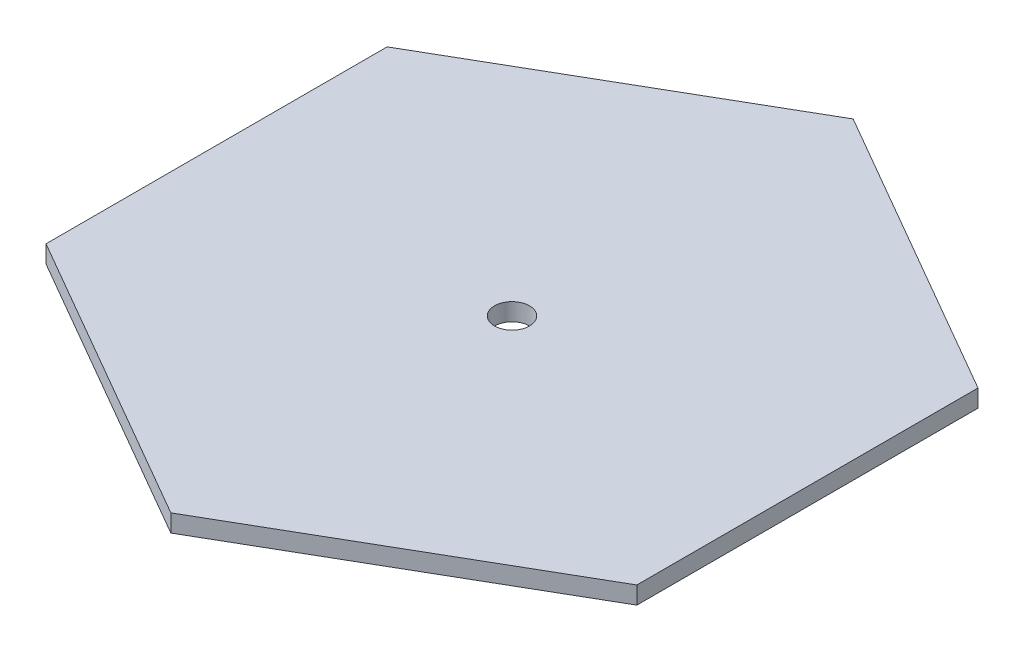
ISO-10303-21;
HEADER;
FILE_DESCRIPTION(('STEP AP214'),'2;1');
FILE_NAME('part.step','',(''),(''),'','','');
FILE_SCHEMA(('AUTOMOTIVE_DESIGN { 1 0 10303 214 1 1 1 1 }'));
ENDSEC;
DATA;
#1=APPLICATION_CONTEXT('core data for automotive mechanical design processes');
#2=APPLICATION_PROTOCOL_DEFINITION('international standard','automotive_design',2000,#1);
#3=PRODUCT_CONTEXT('',#1,'mechanical');
#4=PRODUCT('Part','Part','',(#3));
#5=PRODUCT_RELATED_PRODUCT_CATEGORY('part','',(#4));
#6=PRODUCT_DEFINITION_FORMATION('','',#4);
#7=PRODUCT_DEFINITION_CONTEXT('part definition',#1,'design');
#8=PRODUCT_DEFINITION('design','',#6,#7);
#9=PRODUCT_DEFINITION_SHAPE('','',#8);
#10=(LENGTH_UNIT() NAMED_UNIT(*) SI_UNIT(.MILLI.,.METRE.));
#11=(NAMED_UNIT(*) PLANE_ANGLE_UNIT() SI_UNIT($,.RADIAN.));
#12=(NAMED_UNIT(*) SI_UNIT($,.STERADIAN.) SOLID_ANGLE_UNIT());
#13=UNCERTAINTY_MEASURE_WITH_UNIT(LENGTH_MEASURE(1.E-05),#10,'distance_accuracy_value','');
#14=(GEOMETRIC_REPRESENTATION_CONTEXT(3) GLOBAL_UNCERTAINTY_ASSIGNED_CONTEXT((#13)) GLOBAL_UNIT_ASSIGNED_CONTEXT((#10,
#11,#12)) REPRESENTATION_CONTEXT('',''));
#15=CARTESIAN_POINT('',(0.,0.,0.));
#16=DIRECTION('',(0.,0.,1.));
#17=DIRECTION('',(1.,0.,0.));
#18=AXIS2_PLACEMENT_3D('',#15,#16,#17);
#19=CARTESIAN_POINT('',(33.7749907475931,2.,19.5));
#20=DIRECTION('',(-1.,0.,0.));
#21=DIRECTION('',(0.,0.,1.));
#22=AXIS2_PLACEMENT_3D('',#19,#20,#21);
#23=PLANE('',#22);
#24=DIRECTION('',(0.,0.,-1.));
#25=VECTOR('',#24,1.);
#26=CARTESIAN_POINT('',(33.7749907475931,0.,19.5));
#27=LINE('',#26,#25);
#28=CARTESIAN_POINT('',(33.7749907475931,0.,19.5));
#29=VERTEX_POINT('',#28);
#30=CARTESIAN_POINT('',(33.7749907475931,0.,-19.5));
#31=VERTEX_POINT('',#30);
#32=EDGE_CURVE('E116',#29,#31,#27,.T.);
#33=ORIENTED_EDGE('',*,*,#32,.T.);
#34=DIRECTION('',(0.,-1.,0.));
#35=VECTOR('',#34,1.);
#36=CARTESIAN_POINT('',(33.7749907475931,2.,-19.5));
#37=LINE('',#36,#35);
#38=CARTESIAN_POINT('',(33.7749907475931,2.,-19.5));
#39=VERTEX_POINT('',#38);
#40=EDGE_CURVE('E11',#39,#31,#37,.T.);
#41=ORIENTED_EDGE('',*,*,#40,.F.);
#42=DIRECTION('',(0.,0.,-1.));
#43=VECTOR('',#42,1.);
#44=CARTESIAN_POINT('',(33.7749907475931,2.,19.5));
#45=LINE('',#44,#43);
#46=CARTESIAN_POINT('',(33.7749907475931,2.,19.5));
#47=VERTEX_POINT('',#46);
#48=EDGE_CURVE('E127',#47,#39,#45,.T.);
#49=ORIENTED_EDGE('',*,*,#48,.F.);
#50=DIRECTION('',(0.,-1.,0.));
#51=VECTOR('',#50,1.);
#52=CARTESIAN_POINT('',(33.7749907475931,2.,19.5));
#53=LINE('',#52,#51);
#54=EDGE_CURVE('E112',#47,#29,#53,.T.);
#55=ORIENTED_EDGE('',*,*,#54,.T.);
#56=EDGE_LOOP('',(#33,#41,#49,#55));
#57=FACE_BOUND('',#56,.T.);
#58=ADVANCED_FACE('F32',(#57),#23,.F.);
#59=CARTESIAN_POINT('',(33.7749907475931,2.,-19.5));
#60=DIRECTION('',(-0.5,0.,0.866025403784439));
#61=DIRECTION('',(0.866025403784439,0.,0.5));
#62=AXIS2_PLACEMENT_3D('',#59,#60,#61);
#63=PLANE('',#62);
#64=DIRECTION('',(-0.866025403784439,0.,-0.5));
#65=VECTOR('',#64,1.);
#66=CARTESIAN_POINT('',(33.7749907475931,0.,-19.5));
#67=LINE('',#66,#65);
#68=CARTESIAN_POINT('',(0.,0.,-39.));
#69=VERTEX_POINT('',#68);
#70=EDGE_CURVE('E119',#31,#69,#67,.T.);
#71=ORIENTED_EDGE('',*,*,#70,.T.);
#72=DIRECTION('',(0.,-1.,0.));
#73=VECTOR('',#72,1.);
#74=CARTESIAN_POINT('',(0.,2.,-39.));
#75=LINE('',#74,#73);
#76=CARTESIAN_POINT('',(0.,2.,-39.));
#77=VERTEX_POINT('',#76);
#78=EDGE_CURVE('E40',#77,#69,#75,.T.);
#79=ORIENTED_EDGE('',*,*,#78,.F.);
#80=DIRECTION('',(-0.866025403784439,0.,-0.5));
#81=VECTOR('',#80,1.);
#82=CARTESIAN_POINT('',(33.7749907475931,2.,-19.5));
#83=LINE('',#82,#81);
#84=EDGE_CURVE('E85',#39,#77,#83,.T.);
#85=ORIENTED_EDGE('',*,*,#84,.F.);
#86=ORIENTED_EDGE('',*,*,#40,.T.);
#87=EDGE_LOOP('',(#71,#79,#85,#86));
#88=FACE_BOUND('',#87,.T.);
#89=ADVANCED_FACE('F152',(#88),#63,.F.);
#90=CARTESIAN_POINT('',(0.,2.,-39.));
#91=DIRECTION('',(0.5,0.,0.866025403784439));
#92=DIRECTION('',(0.866025403784439,0.,-0.5));
#93=AXIS2_PLACEMENT_3D('',#90,#91,#92);
#94=PLANE('',#93);
#95=DIRECTION('',(-0.866025403784439,0.,0.5));
#96=VECTOR('',#95,1.);
#97=CARTESIAN_POINT('',(0.,0.,-39.));
#98=LINE('',#97,#96);
#99=CARTESIAN_POINT('',(-33.7749907475931,0.,-19.5));
#100=VERTEX_POINT('',#99);
#101=EDGE_CURVE('E122',#69,#100,#98,.T.);
#102=ORIENTED_EDGE('',*,*,#101,.T.);
#103=DIRECTION('',(0.,-1.,0.));
#104=VECTOR('',#103,1.);
#105=CARTESIAN_POINT('',(-33.7749907475931,2.,-19.5));
#106=LINE('',#105,#104);
#107=CARTESIAN_POINT('',(-33.7749907475931,2.,-19.5));
#108=VERTEX_POINT('',#107);
#109=EDGE_CURVE('E107',#108,#100,#106,.T.);
#110=ORIENTED_EDGE('',*,*,#109,.F.);
#111=DIRECTION('',(-0.866025403784439,0.,0.5));
#112=VECTOR('',#111,1.);
#113=CARTESIAN_POINT('',(0.,2.,-39.));
#114=LINE('',#113,#112);
#115=EDGE_CURVE('E98',#77,#108,#114,.T.);
#116=ORIENTED_EDGE('',*,*,#115,.F.);
#117=ORIENTED_EDGE('',*,*,#78,.T.);
#118=EDGE_LOOP('',(#102,#110,#116,#117));
#119=FACE_BOUND('',#118,.T.);
#120=ADVANCED_FACE('F133',(#119),#94,.F.);
#121=CARTESIAN_POINT('',(-33.7749907475931,2.,-19.5));
#122=DIRECTION('',(1.,0.,0.));
#123=DIRECTION('',(0.,0.,-1.));
#124=AXIS2_PLACEMENT_3D('',#121,#122,#123);
#125=PLANE('',#124);
#126=DIRECTION('',(0.,0.,1.));
#127=VECTOR('',#126,1.);
#128=CARTESIAN_POINT('',(-33.7749907475931,0.,-19.5));
#129=LINE('',#128,#127);
#130=CARTESIAN_POINT('',(-33.7749907475931,0.,19.5));
#131=VERTEX_POINT('',#130);
#132=EDGE_CURVE('E106',#100,#131,#129,.T.);
#133=ORIENTED_EDGE('',*,*,#132,.T.);
#134=DIRECTION('',(0.,-1.,0.));
#135=VECTOR('',#134,1.);
#136=CARTESIAN_POINT('',(-33.7749907475931,2.,19.5));
#137=LINE('',#136,#135);
#138=CARTESIAN_POINT('',(-33.7749907475931,2.,19.5));
#139=VERTEX_POINT('',#138);
#140=EDGE_CURVE('E103',#139,#131,#137,.T.);
#141=ORIENTED_EDGE('',*,*,#140,.F.);
#142=DIRECTION('',(0.,0.,1.));
#143=VECTOR('',#142,1.);
#144=CARTESIAN_POINT('',(-33.7749907475931,2.,-19.5));
#145=LINE('',#144,#143);
#146=EDGE_CURVE('E92',#108,#139,#145,.T.);
#147=ORIENTED_EDGE('',*,*,#146,.F.);
#148=ORIENTED_EDGE('',*,*,#109,.T.);
#149=EDGE_LOOP('',(#133,#141,#147,#148));
#150=FACE_BOUND('',#149,.T.);
#151=ADVANCED_FACE('F104',(#150),#125,.F.);
#152=CARTESIAN_POINT('',(-33.7749907475931,2.,19.5));
#153=DIRECTION('',(0.5,0.,-0.866025403784439));
#154=DIRECTION('',(-0.866025403784439,0.,-0.5));
#155=AXIS2_PLACEMENT_3D('',#152,#153,#154);
#156=PLANE('',#155);
#157=DIRECTION('',(0.866025403784439,0.,0.5));
#158=VECTOR('',#157,1.);
#159=CARTESIAN_POINT('',(-33.7749907475931,0.,19.5));
#160=LINE('',#159,#158);
#161=CARTESIAN_POINT('',(0.,0.,39.));
#162=VERTEX_POINT('',#161);
#163=EDGE_CURVE('E71',#131,#162,#160,.T.);
#164=ORIENTED_EDGE('',*,*,#163,.T.);
#165=DIRECTION('',(0.,-1.,0.));
#166=VECTOR('',#165,1.);
#167=CARTESIAN_POINT('',(0.,2.,39.));
#168=LINE('',#167,#166);
#169=CARTESIAN_POINT('',(0.,2.,39.));
#170=VERTEX_POINT('',#169);
#171=EDGE_CURVE('E108',#170,#162,#168,.T.);
#172=ORIENTED_EDGE('',*,*,#171,.F.);
#173=DIRECTION('',(0.866025403784439,0.,0.5));
#174=VECTOR('',#173,1.);
#175=CARTESIAN_POINT('',(-33.7749907475931,2.,19.5));
#176=LINE('',#175,#174);
#177=EDGE_CURVE('E96',#139,#170,#176,.T.);
#178=ORIENTED_EDGE('',*,*,#177,.F.);
#179=ORIENTED_EDGE('',*,*,#140,.T.);
#180=EDGE_LOOP('',(#164,#172,#178,#179));
#181=FACE_BOUND('',#180,.T.);
#182=ADVANCED_FACE('F110',(#181),#156,.F.);
#183=CARTESIAN_POINT('',(0.,2.,39.));
#184=DIRECTION('',(-0.5,0.,-0.866025403784439));
#185=DIRECTION('',(-0.866025403784439,0.,0.5));
#186=AXIS2_PLACEMENT_3D('',#183,#184,#185);
#187=PLANE('',#186);
#188=DIRECTION('',(0.866025403784439,0.,-0.5));
#189=VECTOR('',#188,1.);
#190=CARTESIAN_POINT('',(0.,0.,39.));
#191=LINE('',#190,#189);
#192=EDGE_CURVE('E77',#162,#29,#191,.T.);
#193=ORIENTED_EDGE('',*,*,#192,.T.);
#194=ORIENTED_EDGE('',*,*,#54,.F.);
#195=DIRECTION('',(0.866025403784439,0.,-0.5));
#196=VECTOR('',#195,1.);
#197=CARTESIAN_POINT('',(0.,2.,39.));
#198=LINE('',#197,#196);
#199=EDGE_CURVE('E48',#170,#47,#198,.T.);
#200=ORIENTED_EDGE('',*,*,#199,.F.);
#201=ORIENTED_EDGE('',*,*,#171,.T.);
#202=EDGE_LOOP('',(#193,#194,#200,#201));
#203=FACE_BOUND('',#202,.T.);
#204=ADVANCED_FACE('F140',(#203),#187,.F.);
#205=CARTESIAN_POINT('',(0.,2.,0.));
#206=DIRECTION('',(0.,1.,0.));
#207=DIRECTION('',(0.,0.,1.));
#208=AXIS2_PLACEMENT_3D('',#205,#206,#207);
#209=PLANE('',#208);
#210=CARTESIAN_POINT('',(0.,2.,0.));
#211=DIRECTION('',(0.,1.,0.));
#212=DIRECTION('',(0.,0.,1.));
#213=AXIS2_PLACEMENT_3D('',#210,#211,#212);
#214=CIRCLE('',#213,2.);
#215=CARTESIAN_POINT('',(0.,2.,2.));
#216=VERTEX_POINT('',#215);
#217=EDGE_CURVE('E205',#216,#216,#214,.T.);
#218=ORIENTED_EDGE('',*,*,#217,.F.);
#219=EDGE_LOOP('',(#218));
#220=FACE_BOUND('',#219,.T.);
#221=ORIENTED_EDGE('',*,*,#48,.T.);
#222=ORIENTED_EDGE('',*,*,#84,.T.);
#223=ORIENTED_EDGE('',*,*,#115,.T.);
#224=ORIENTED_EDGE('',*,*,#146,.T.);
#225=ORIENTED_EDGE('',*,*,#177,.T.);
#226=ORIENTED_EDGE('',*,*,#199,.T.);
#227=EDGE_LOOP('',(#221,#222,#223,#224,#225,#226));
#228=FACE_BOUND('',#227,.T.);
#229=ADVANCED_FACE('F94',(#220,#228),#209,.T.);
#230=CARTESIAN_POINT('',(0.,0.,0.));
#231=DIRECTION('',(0.,1.,0.));
#232=DIRECTION('',(0.,0.,1.));
#233=AXIS2_PLACEMENT_3D('',#230,#231,#232);
#234=PLANE('',#233);
#235=CARTESIAN_POINT('',(0.,0.,0.));
#236=DIRECTION('',(0.,1.,0.));
#237=DIRECTION('',(0.,0.,1.));
#238=AXIS2_PLACEMENT_3D('',#235,#236,#237);
#239=CIRCLE('',#238,2.);
#240=CARTESIAN_POINT('',(0.,0.,2.));
#241=VERTEX_POINT('',#240);
#242=EDGE_CURVE('E120',#241,#241,#239,.F.);
#243=ORIENTED_EDGE('',*,*,#242,.F.);
#244=EDGE_LOOP('',(#243));
#245=FACE_BOUND('',#244,.T.);
#246=ORIENTED_EDGE('',*,*,#32,.F.);
#247=ORIENTED_EDGE('',*,*,#192,.F.);
#248=ORIENTED_EDGE('',*,*,#163,.F.);
#249=ORIENTED_EDGE('',*,*,#132,.F.);
#250=ORIENTED_EDGE('',*,*,#101,.F.);
#251=ORIENTED_EDGE('',*,*,#70,.F.);
#252=EDGE_LOOP('',(#246,#247,#248,#249,#250,#251));
#253=FACE_BOUND('',#252,.T.);
#254=ADVANCED_FACE('F136',(#245,#253),#234,.F.);
#255=CARTESIAN_POINT('',(0.,-0.00100000000000013,0.));
#256=DIRECTION('',(0.,1.,0.));
#257=DIRECTION('',(0.,0.,1.));
#258=AXIS2_PLACEMENT_3D('',#255,#256,#257);
#259=CYLINDRICAL_SURFACE('',#258,2.);
#260=ORIENTED_EDGE('',*,*,#217,.T.);
#261=EDGE_LOOP('',(#260));
#262=FACE_BOUND('',#261,.T.);
#263=ORIENTED_EDGE('',*,*,#242,.T.);
#264=EDGE_LOOP('',(#263));
#265=FACE_BOUND('',#264,.T.);
#266=ADVANCED_FACE('F189',(#262,#265),#259,.F.);
#267=CLOSED_SHELL('',(#58,#89,#120,#151,#182,#204,#229,#254,#266));
#268=MANIFOLD_SOLID_BREP('B2',#267);
#269=ADVANCED_BREP_SHAPE_REPRESENTATION('',(#18,#268),#14);
#270=SHAPE_DEFINITION_REPRESENTATION(#9,#269);
ENDSEC;
END-ISO-10303-21;
